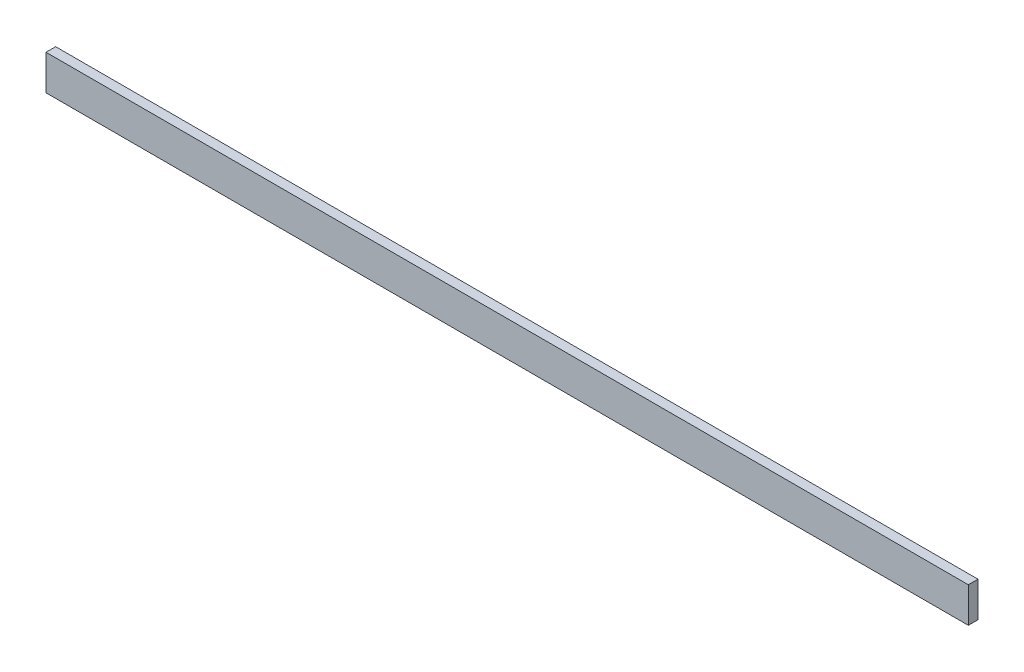
ISO-10303-21;
HEADER;
FILE_DESCRIPTION(('STEP AP214'),'2;1');
FILE_NAME('part.step','',(''),(''),'','','');
FILE_SCHEMA(('AUTOMOTIVE_DESIGN { 1 0 10303 214 1 1 1 1 }'));
ENDSEC;
DATA;
#1=APPLICATION_CONTEXT('core data for automotive mechanical design processes');
#2=APPLICATION_PROTOCOL_DEFINITION('international standard','automotive_design',2000,#1);
#3=PRODUCT_CONTEXT('',#1,'mechanical');
#4=PRODUCT('Part','Part','',(#3));
#5=PRODUCT_RELATED_PRODUCT_CATEGORY('part','',(#4));
#6=PRODUCT_DEFINITION_FORMATION('','',#4);
#7=PRODUCT_DEFINITION_CONTEXT('part definition',#1,'design');
#8=PRODUCT_DEFINITION('design','',#6,#7);
#9=PRODUCT_DEFINITION_SHAPE('','',#8);
#10=(LENGTH_UNIT() NAMED_UNIT(*) SI_UNIT(.MILLI.,.METRE.));
#11=(NAMED_UNIT(*) PLANE_ANGLE_UNIT() SI_UNIT($,.RADIAN.));
#12=(NAMED_UNIT(*) SI_UNIT($,.STERADIAN.) SOLID_ANGLE_UNIT());
#13=UNCERTAINTY_MEASURE_WITH_UNIT(LENGTH_MEASURE(1.E-05),#10,'distance_accuracy_value','');
#14=(GEOMETRIC_REPRESENTATION_CONTEXT(3) GLOBAL_UNCERTAINTY_ASSIGNED_CONTEXT((#13)) GLOBAL_UNIT_ASSIGNED_CONTEXT((#10,
#11,#12)) REPRESENTATION_CONTEXT('',''));
#15=CARTESIAN_POINT('',(0.,0.,0.));
#16=DIRECTION('',(0.,0.,1.));
#17=DIRECTION('',(1.,0.,0.));
#18=AXIS2_PLACEMENT_3D('',#15,#16,#17);
#19=CARTESIAN_POINT('',(0.,80.,0.));
#20=DIRECTION('',(1.,0.,0.));
#21=DIRECTION('',(0.,0.,-1.));
#22=AXIS2_PLACEMENT_3D('',#19,#20,#21);
#23=PLANE('',#22);
#24=DIRECTION('',(0.,0.,1.));
#25=VECTOR('',#24,1.);
#26=CARTESIAN_POINT('',(0.,0.,0.));
#27=LINE('',#26,#25);
#28=CARTESIAN_POINT('',(0.,0.,-22.));
#29=VERTEX_POINT('',#28);
#30=CARTESIAN_POINT('',(0.,0.,0.));
#31=VERTEX_POINT('',#30);
#32=EDGE_CURVE('E94',#29,#31,#27,.T.);
#33=ORIENTED_EDGE('',*,*,#32,.T.);
#34=DIRECTION('',(0.,-1.,0.));
#35=VECTOR('',#34,1.);
#36=CARTESIAN_POINT('',(0.,80.,0.));
#37=LINE('',#36,#35);
#38=CARTESIAN_POINT('',(0.,80.,0.));
#39=VERTEX_POINT('',#38);
#40=EDGE_CURVE('E11',#39,#31,#37,.T.);
#41=ORIENTED_EDGE('',*,*,#40,.F.);
#42=DIRECTION('',(0.,0.,1.));
#43=VECTOR('',#42,1.);
#44=CARTESIAN_POINT('',(0.,80.,0.));
#45=LINE('',#44,#43);
#46=CARTESIAN_POINT('',(0.,80.,-22.));
#47=VERTEX_POINT('',#46);
#48=EDGE_CURVE('E82',#47,#39,#45,.T.);
#49=ORIENTED_EDGE('',*,*,#48,.F.);
#50=DIRECTION('',(0.,-1.,0.));
#51=VECTOR('',#50,1.);
#52=CARTESIAN_POINT('',(0.,80.,-22.));
#53=LINE('',#52,#51);
#54=EDGE_CURVE('E90',#47,#29,#53,.T.);
#55=ORIENTED_EDGE('',*,*,#54,.T.);
#56=EDGE_LOOP('',(#33,#41,#49,#55));
#57=FACE_BOUND('',#56,.T.);
#58=ADVANCED_FACE('F31',(#57),#23,.F.);
#59=CARTESIAN_POINT('',(0.,80.,0.));
#60=DIRECTION('',(0.,0.,-1.));
#61=DIRECTION('',(-1.,0.,0.));
#62=AXIS2_PLACEMENT_3D('',#59,#60,#61);
#63=PLANE('',#62);
#64=DIRECTION('',(1.,0.,0.));
#65=VECTOR('',#64,1.);
#66=CARTESIAN_POINT('',(0.,0.,0.));
#67=LINE('',#66,#65);
#68=CARTESIAN_POINT('',(2100.,0.,0.));
#69=VERTEX_POINT('',#68);
#70=EDGE_CURVE('E86',#31,#69,#67,.T.);
#71=ORIENTED_EDGE('',*,*,#70,.T.);
#72=DIRECTION('',(0.,-1.,0.));
#73=VECTOR('',#72,1.);
#74=CARTESIAN_POINT('',(2100.,80.,0.));
#75=LINE('',#74,#73);
#76=CARTESIAN_POINT('',(2100.,80.,0.));
#77=VERTEX_POINT('',#76);
#78=EDGE_CURVE('E39',#77,#69,#75,.T.);
#79=ORIENTED_EDGE('',*,*,#78,.F.);
#80=DIRECTION('',(1.,0.,0.));
#81=VECTOR('',#80,1.);
#82=CARTESIAN_POINT('',(0.,80.,0.));
#83=LINE('',#82,#81);
#84=EDGE_CURVE('E77',#39,#77,#83,.T.);
#85=ORIENTED_EDGE('',*,*,#84,.F.);
#86=ORIENTED_EDGE('',*,*,#40,.T.);
#87=EDGE_LOOP('',(#71,#79,#85,#86));
#88=FACE_BOUND('',#87,.T.);
#89=ADVANCED_FACE('F85',(#88),#63,.F.);
#90=CARTESIAN_POINT('',(2100.,80.,0.));
#91=DIRECTION('',(-1.,0.,0.));
#92=DIRECTION('',(0.,0.,1.));
#93=AXIS2_PLACEMENT_3D('',#90,#91,#92);
#94=PLANE('',#93);
#95=DIRECTION('',(0.,0.,-1.));
#96=VECTOR('',#95,1.);
#97=CARTESIAN_POINT('',(2100.,0.,0.));
#98=LINE('',#97,#96);
#99=CARTESIAN_POINT('',(2100.,0.,-22.));
#100=VERTEX_POINT('',#99);
#101=EDGE_CURVE('E64',#69,#100,#98,.T.);
#102=ORIENTED_EDGE('',*,*,#101,.T.);
#103=DIRECTION('',(0.,-1.,0.));
#104=VECTOR('',#103,1.);
#105=CARTESIAN_POINT('',(2100.,80.,-22.));
#106=LINE('',#105,#104);
#107=CARTESIAN_POINT('',(2100.,80.,-22.));
#108=VERTEX_POINT('',#107);
#109=EDGE_CURVE('E87',#108,#100,#106,.T.);
#110=ORIENTED_EDGE('',*,*,#109,.F.);
#111=DIRECTION('',(0.,0.,-1.));
#112=VECTOR('',#111,1.);
#113=CARTESIAN_POINT('',(2100.,80.,0.));
#114=LINE('',#113,#112);
#115=EDGE_CURVE('E80',#77,#108,#114,.T.);
#116=ORIENTED_EDGE('',*,*,#115,.F.);
#117=ORIENTED_EDGE('',*,*,#78,.T.);
#118=EDGE_LOOP('',(#102,#110,#116,#117));
#119=FACE_BOUND('',#118,.T.);
#120=ADVANCED_FACE('F88',(#119),#94,.F.);
#121=CARTESIAN_POINT('',(0.,80.,-22.));
#122=DIRECTION('',(0.,0.,1.));
#123=DIRECTION('',(1.,0.,0.));
#124=AXIS2_PLACEMENT_3D('',#121,#122,#123);
#125=PLANE('',#124);
#126=DIRECTION('',(-1.,0.,0.));
#127=VECTOR('',#126,1.);
#128=CARTESIAN_POINT('',(0.,0.,-22.));
#129=LINE('',#128,#127);
#130=EDGE_CURVE('E70',#100,#29,#129,.T.);
#131=ORIENTED_EDGE('',*,*,#130,.T.);
#132=ORIENTED_EDGE('',*,*,#54,.F.);
#133=DIRECTION('',(-1.,0.,0.));
#134=VECTOR('',#133,1.);
#135=CARTESIAN_POINT('',(0.,80.,-22.));
#136=LINE('',#135,#134);
#137=EDGE_CURVE('E47',#108,#47,#136,.T.);
#138=ORIENTED_EDGE('',*,*,#137,.F.);
#139=ORIENTED_EDGE('',*,*,#109,.T.);
#140=EDGE_LOOP('',(#131,#132,#138,#139));
#141=FACE_BOUND('',#140,.T.);
#142=ADVANCED_FACE('F101',(#141),#125,.F.);
#143=CARTESIAN_POINT('',(0.,80.,-22.));
#144=DIRECTION('',(0.,-1.,0.));
#145=DIRECTION('',(0.,0.,-1.));
#146=AXIS2_PLACEMENT_3D('',#143,#144,#145);
#147=PLANE('',#146);
#148=ORIENTED_EDGE('',*,*,#48,.T.);
#149=ORIENTED_EDGE('',*,*,#84,.T.);
#150=ORIENTED_EDGE('',*,*,#115,.T.);
#151=ORIENTED_EDGE('',*,*,#137,.T.);
#152=EDGE_LOOP('',(#148,#149,#150,#151));
#153=FACE_BOUND('',#152,.T.);
#154=ADVANCED_FACE('F78',(#153),#147,.F.);
#155=CARTESIAN_POINT('',(0.,0.,-22.));
#156=DIRECTION('',(0.,-1.,0.));
#157=DIRECTION('',(0.,0.,-1.));
#158=AXIS2_PLACEMENT_3D('',#155,#156,#157);
#159=PLANE('',#158);
#160=ORIENTED_EDGE('',*,*,#32,.F.);
#161=ORIENTED_EDGE('',*,*,#130,.F.);
#162=ORIENTED_EDGE('',*,*,#101,.F.);
#163=ORIENTED_EDGE('',*,*,#70,.F.);
#164=EDGE_LOOP('',(#160,#161,#162,#163));
#165=FACE_BOUND('',#164,.T.);
#166=ADVANCED_FACE('F104',(#165),#159,.T.);
#167=CLOSED_SHELL('',(#58,#89,#120,#142,#154,#166));
#168=MANIFOLD_SOLID_BREP('B2',#167);
#169=ADVANCED_BREP_SHAPE_REPRESENTATION('',(#18,#168),#14);
#170=SHAPE_DEFINITION_REPRESENTATION(#9,#169);
ENDSEC;
END-ISO-10303-21;
